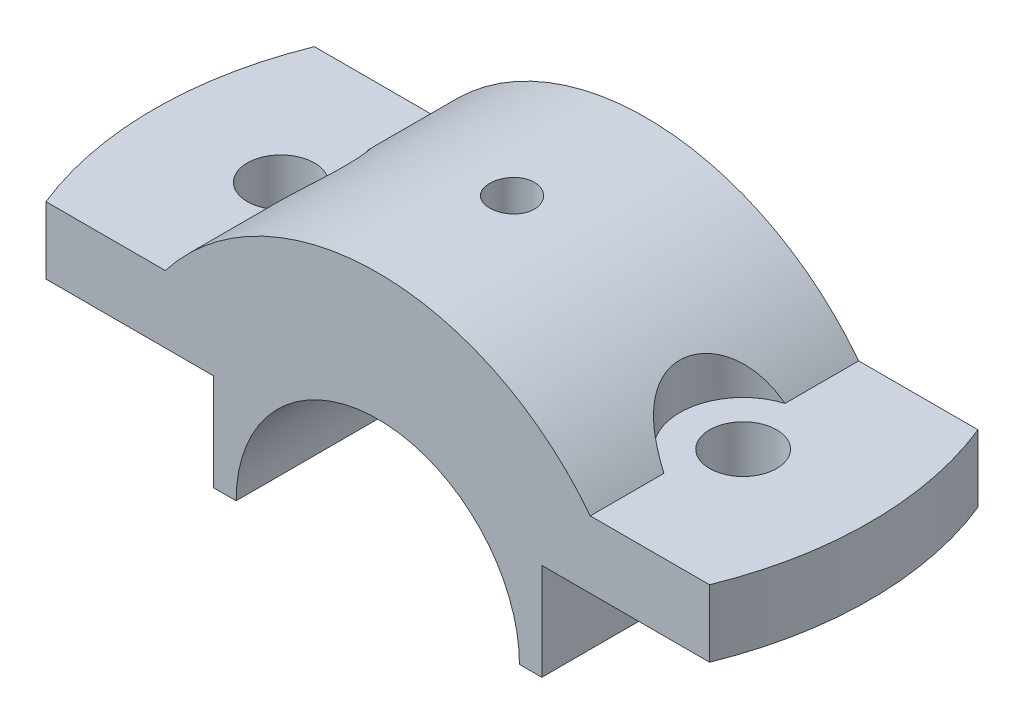
ISO-10303-21;
HEADER;
FILE_DESCRIPTION(('STEP AP214'),'2;1');
FILE_NAME('part.step','',(''),(''),'','','');
FILE_SCHEMA(('AUTOMOTIVE_DESIGN { 1 0 10303 214 1 1 1 1 }'));
ENDSEC;
DATA;
#1=APPLICATION_CONTEXT('core data for automotive mechanical design processes');
#2=APPLICATION_PROTOCOL_DEFINITION('international standard','automotive_design',2000,#1);
#3=PRODUCT_CONTEXT('',#1,'mechanical');
#4=PRODUCT('Part','Part','',(#3));
#5=PRODUCT_RELATED_PRODUCT_CATEGORY('part','',(#4));
#6=PRODUCT_DEFINITION_FORMATION('','',#4);
#7=PRODUCT_DEFINITION_CONTEXT('part definition',#1,'design');
#8=PRODUCT_DEFINITION('design','',#6,#7);
#9=PRODUCT_DEFINITION_SHAPE('','',#8);
#10=(LENGTH_UNIT() NAMED_UNIT(*) SI_UNIT(.MILLI.,.METRE.));
#11=(NAMED_UNIT(*) PLANE_ANGLE_UNIT() SI_UNIT($,.RADIAN.));
#12=(NAMED_UNIT(*) SI_UNIT($,.STERADIAN.) SOLID_ANGLE_UNIT());
#13=UNCERTAINTY_MEASURE_WITH_UNIT(LENGTH_MEASURE(1.E-05),#10,'distance_accuracy_value','');
#14=(GEOMETRIC_REPRESENTATION_CONTEXT(3) GLOBAL_UNCERTAINTY_ASSIGNED_CONTEXT((#13)) GLOBAL_UNIT_ASSIGNED_CONTEXT((#10,
#11,#12)) REPRESENTATION_CONTEXT('',''));
#15=CARTESIAN_POINT('',(0.,0.,0.));
#16=DIRECTION('',(0.,0.,1.));
#17=DIRECTION('',(1.,0.,0.));
#18=AXIS2_PLACEMENT_3D('',#15,#16,#17);
#19=CARTESIAN_POINT('',(0.,6.,18.));
#20=DIRECTION('',(0.,0.,-1.));
#21=DIRECTION('',(-1.,0.,0.));
#22=AXIS2_PLACEMENT_3D('',#19,#20,#21);
#23=CYLINDRICAL_SURFACE('',#22,36.);
#24=CARTESIAN_POINT('',(28.49561369755,28.,-8.12268731689832));
#25=CARTESIAN_POINT('',(28.3883429956897,28.1389449038792,-8.08961032460877));
#26=CARTESIAN_POINT('',(28.2803517799696,28.2767174981742,-8.05399064427992));
#27=CARTESIAN_POINT('',(28.0631084249399,28.5497756965527,-7.97733985421052));
#28=CARTESIAN_POINT('',(27.9538560857525,28.6850608973445,-7.93630787561411));
#29=CARTESIAN_POINT('',(27.624064794657,29.0874726458448,-7.80443543463378));
#30=CARTESIAN_POINT('',(27.4019476568077,29.350565318649,-7.7049558228802));
#31=CARTESIAN_POINT('',(26.9535217386165,29.8668357179367,-7.47928466451793));
#32=CARTESIAN_POINT('',(26.7271935399044,30.1198771773695,-7.35281860163648));
#33=CARTESIAN_POINT('',(26.2759869991675,30.6106353698816,-7.0713707967826));
#34=CARTESIAN_POINT('',(26.0511074262058,30.848367284912,-6.91641791105808));
#35=CARTESIAN_POINT('',(25.6748826842322,31.2358757966231,-6.62803093506917));
#36=CARTESIAN_POINT('',(25.5221415176003,31.3902627098833,-6.50257691639347));
#37=CARTESIAN_POINT('',(25.2208416805143,31.6895733918695,-6.23632306486193));
#38=CARTESIAN_POINT('',(25.0722819827196,31.8344994967615,-6.09552704351683));
#39=CARTESIAN_POINT('',(24.7817037096736,32.1133600457314,-5.79877146781272));
#40=CARTESIAN_POINT('',(24.6396622991177,32.247334392497,-5.64287194094596));
#41=CARTESIAN_POINT('',(24.3635406556831,32.5038371601368,-5.31537913185122));
#42=CARTESIAN_POINT('',(24.2294591470371,32.6263674170184,-5.14378837578346));
#43=CARTESIAN_POINT('',(23.9904509819345,32.8417624711389,-4.81162122960556));
#44=CARTESIAN_POINT('',(23.8841398500846,32.9363379004424,-4.65314864351983));
#45=CARTESIAN_POINT('',(23.6802965576756,33.115714689819,-4.32540935764653));
#46=CARTESIAN_POINT('',(23.5827627586561,33.2005178749047,-4.15614468253373));
#47=CARTESIAN_POINT('',(23.3978102955432,33.3597768046585,-3.80732279303356));
#48=CARTESIAN_POINT('',(23.3103987752574,33.4342252488207,-3.62775844168245));
#49=CARTESIAN_POINT('',(23.147151883429,33.5721015400056,-3.25935042000544));
#50=CARTESIAN_POINT('',(23.0713166506265,33.6355292549477,-3.07050663850279));
#51=CARTESIAN_POINT('',(22.9321367747935,33.7511322556298,-2.6836656627764));
#52=CARTESIAN_POINT('',(22.8688621846752,33.8032445767836,-2.48562433728759));
#53=CARTESIAN_POINT('',(22.7564750532109,33.895306588694,-2.08279108022074));
#54=CARTESIAN_POINT('',(22.7073627482296,33.9352560764568,-1.8779990360386));
#55=CARTESIAN_POINT('',(22.6242601718905,34.0026019753348,-1.46343860862133));
#56=CARTESIAN_POINT('',(22.5902628078343,34.0300042744095,-1.25367260819839));
#57=CARTESIAN_POINT('',(22.5380318988656,34.0720190124141,-0.830928192550831));
#58=CARTESIAN_POINT('',(22.51979677656,34.0866327311523,-0.617950100944409));
#59=CARTESIAN_POINT('',(22.5004913633291,34.1020997752325,-0.212628566388742));
#60=CARTESIAN_POINT('',(22.497854802396,34.1042087688774,-0.0204050310327507));
#61=CARTESIAN_POINT('',(22.5056099635788,34.097999008733,0.363610565532796));
#62=CARTESIAN_POINT('',(22.5160013311382,34.0896805387283,0.555402638342344));
#63=CARTESIAN_POINT('',(22.5496390603622,34.062684114114,0.937066674771809));
#64=CARTESIAN_POINT('',(22.5728821657172,34.0440087836706,1.1269391123751));
#65=CARTESIAN_POINT('',(22.6318470056782,33.9964450023637,1.50343686718247));
#66=CARTESIAN_POINT('',(22.6675688598692,33.9675564536259,1.6900621532508));
#67=CARTESIAN_POINT('',(22.7499755259529,33.9005620378108,2.05455855243696));
#68=CARTESIAN_POINT('',(22.7963912886814,33.8626817814698,2.23253225524283));
#69=CARTESIAN_POINT('',(22.899943159068,33.7776364962229,2.58311822676518));
#70=CARTESIAN_POINT('',(22.957082779793,33.7304684244387,2.75572871686819));
#71=CARTESIAN_POINT('',(23.0812634454929,33.627192986098,3.09453698451963));
#72=CARTESIAN_POINT('',(23.1483022314465,33.5710876588225,3.26073621425327));
#73=CARTESIAN_POINT('',(23.2914316150844,33.4502820102928,3.58602340185803));
#74=CARTESIAN_POINT('',(23.3675255332824,33.3855785350795,3.74510872145834));
#75=CARTESIAN_POINT('',(23.533252580508,33.2433246473684,4.0660140503512));
#76=CARTESIAN_POINT('',(23.623454305258,33.1652001012255,4.22728566326227));
#77=CARTESIAN_POINT('',(23.8119380159658,33.0001352649935,4.5403938002285));
#78=CARTESIAN_POINT('',(23.9102232179064,32.9131914629533,4.69222652646232));
#79=CARTESIAN_POINT('',(24.1136413044609,32.7310853663116,4.98597770349862));
#80=CARTESIAN_POINT('',(24.2187726643371,32.6359249001509,5.1278983473706));
#81=CARTESIAN_POINT('',(24.4347669427714,32.4379206709831,5.40167880401735));
#82=CARTESIAN_POINT('',(24.5456310123462,32.3350753631499,5.53353658310335));
#83=CARTESIAN_POINT('',(24.822492443997,32.0747818585769,5.84369630347675));
#84=CARTESIAN_POINT('',(24.9910291117,31.9134362337436,6.01648777656109));
#85=CARTESIAN_POINT('',(25.3348030409857,31.5774427466892,6.34125494264379));
#86=CARTESIAN_POINT('',(25.5100429600618,31.402789580918,6.49322226820977));
#87=CARTESIAN_POINT('',(25.8651555357775,31.0411295792422,6.77755742192985));
#88=CARTESIAN_POINT('',(26.0450417791957,30.8540832094598,6.9098576850827));
#89=CARTESIAN_POINT('',(26.4066048290322,30.4695902961508,7.15531019534775));
#90=CARTESIAN_POINT('',(26.5882813073606,30.2721456304919,7.26846588440781));
#91=CARTESIAN_POINT('',(26.9163314018469,29.9073020355787,7.45668423696381));
#92=CARTESIAN_POINT('',(27.0627139489859,29.7415082358916,7.5348778482434));
#93=CARTESIAN_POINT('',(27.3546693051919,29.4045244685477,7.6803751331004));
#94=CARTESIAN_POINT('',(27.5002421144228,29.2333345019822,7.74767880888012));
#95=CARTESIAN_POINT('',(27.7886657121799,28.8875574614039,7.87157992535376));
#96=CARTESIAN_POINT('',(27.931529113767,28.713011468592,7.92826325949936));
#97=CARTESIAN_POINT('',(28.2152179439878,28.3596276236826,8.03229531552802));
#98=CARTESIAN_POINT('',(28.3560440173533,28.1807911791704,8.07964705313067));
#99=CARTESIAN_POINT('',(28.49561369755,28.,8.12268731689833));
#100=B_SPLINE_CURVE_WITH_KNOTS('',3,(#24,#25,#26,#27,#28,#29,#30,#31,#32,#33,#34,#35,#36,#37,
#38,#39,#40,#41,#42,#43,#44,#45,#46,#47,#48,#49,#50,#51,#52,#53,#54,#55,#56,#57,#58,#59,#60,#61,
#62,#63,#64,#65,#66,#67,#68,#69,#70,#71,#72,#73,#74,#75,#76,#77,#78,#79,#80,#81,#82,#83,#84,#85,
#86,#87,#88,#89,#90,#91,#92,#93,#94,#95,#96,#97,#98,#99),.UNSPECIFIED.,.F.,.F.,(4,2,2,2,2,2,2,2,
2,2,2,2,2,2,2,2,2,2,2,2,2,2,2,2,2,2,2,2,2,2,2,2,2,2,2,2,2,4),(0.,0.535828027991022,
1.07174217932421,2.1458403738668,3.23143526368291,4.31593647962146,5.06775834846669,
5.81939386147159,6.56815589387726,7.31679759319879,7.9551044460551,8.59329189824958,
9.23192704166824,9.87056983843394,10.5126801305605,11.1548011387114,11.7966205121982,
12.4383756487133,13.0144245972337,13.5904578688623,14.1663452548777,14.7422381598258,
15.3049767404347,15.8678999933871,16.4306949834014,16.9936969898067,17.5949457219388,
18.1964348267228,18.7977904263809,19.3992672389542,20.2689684172323,21.1390180352076,
22.0119908106056,22.8848064695746,23.5882401398081,24.2916736677842,24.9891461674246,
25.6863928918425),.UNSPECIFIED.);
#101=CARTESIAN_POINT('',(28.49561369755,28.,-8.12268731689833));
#102=VERTEX_POINT('',#101);
#103=CARTESIAN_POINT('',(28.49561369755,28.,8.12268731689832));
#104=VERTEX_POINT('',#103);
#105=EDGE_CURVE('E141',#102,#104,#100,.T.);
#106=ORIENTED_EDGE('',*,*,#105,.F.);
#107=DIRECTION('',(0.,0.,-1.));
#108=VECTOR('',#107,1.);
#109=CARTESIAN_POINT('',(28.49561369755,28.,18.));
#110=LINE('',#109,#108);
#111=CARTESIAN_POINT('',(28.49561369755,28.,-18.));
#112=VERTEX_POINT('',#111);
#113=EDGE_CURVE('E148',#102,#112,#110,.T.);
#114=ORIENTED_EDGE('',*,*,#113,.T.);
#115=CARTESIAN_POINT('',(0.,6.,-18.));
#116=DIRECTION('',(0.,0.,1.));
#117=DIRECTION('',(1.,0.,0.));
#118=AXIS2_PLACEMENT_3D('',#115,#116,#117);
#119=CIRCLE('',#118,36.);
#120=CARTESIAN_POINT('',(-28.49561369755,28.,-18.));
#121=VERTEX_POINT('',#120);
#122=EDGE_CURVE('E435',#112,#121,#119,.T.);
#123=ORIENTED_EDGE('',*,*,#122,.T.);
#124=DIRECTION('',(0.,0.,-1.));
#125=VECTOR('',#124,1.);
#126=CARTESIAN_POINT('',(-28.49561369755,28.,18.));
#127=LINE('',#126,#125);
#128=CARTESIAN_POINT('',(-28.49561369755,28.,-8.12268731689832));
#129=VERTEX_POINT('',#128);
#130=EDGE_CURVE('E160',#129,#121,#127,.T.);
#131=ORIENTED_EDGE('',*,*,#130,.F.);
#132=CARTESIAN_POINT('',(-28.49561369755,28.,8.12268731689832));
#133=CARTESIAN_POINT('',(-28.3883429956897,28.1389449038792,8.08961032460876));
#134=CARTESIAN_POINT('',(-28.2803517799696,28.2767174981742,8.05399064427992));
#135=CARTESIAN_POINT('',(-28.0631084249399,28.5497756965527,7.97733985421052));
#136=CARTESIAN_POINT('',(-27.9538560857525,28.6850608973446,7.93630787561411));
#137=CARTESIAN_POINT('',(-27.624064794657,29.0874726458448,7.80443543463377));
#138=CARTESIAN_POINT('',(-27.4019476568077,29.350565318649,7.7049558228802));
#139=CARTESIAN_POINT('',(-26.9535217386165,29.8668357179367,7.47928466451793));
#140=CARTESIAN_POINT('',(-26.7271935399044,30.1198771773695,7.35281860163648));
#141=CARTESIAN_POINT('',(-26.2759869991675,30.6106353698816,7.0713707967826));
#142=CARTESIAN_POINT('',(-26.0511074262058,30.848367284912,6.91641791105808));
#143=CARTESIAN_POINT('',(-25.6748826842322,31.2358757966231,6.62803093506917));
#144=CARTESIAN_POINT('',(-25.5221415176003,31.3902627098833,6.50257691639347));
#145=CARTESIAN_POINT('',(-25.2208416805143,31.6895733918695,6.23632306486193));
#146=CARTESIAN_POINT('',(-25.0722819827196,31.8344994967615,6.09552704351684));
#147=CARTESIAN_POINT('',(-24.7817037096736,32.1133600457314,5.79877146781272));
#148=CARTESIAN_POINT('',(-24.6396622991177,32.247334392497,5.64287194094597));
#149=CARTESIAN_POINT('',(-24.3635406556831,32.5038371601367,5.31537913185122));
#150=CARTESIAN_POINT('',(-24.2294591470371,32.6263674170184,5.14378837578346));
#151=CARTESIAN_POINT('',(-23.9904509819345,32.8417624711389,4.81162122960557));
#152=CARTESIAN_POINT('',(-23.8841398500846,32.9363379004424,4.65314864351984));
#153=CARTESIAN_POINT('',(-23.6802965576756,33.115714689819,4.32540935764653));
#154=CARTESIAN_POINT('',(-23.5827627586561,33.2005178749047,4.15614468253374));
#155=CARTESIAN_POINT('',(-23.3978102955432,33.3597768046585,3.80732279303356));
#156=CARTESIAN_POINT('',(-23.3103987752574,33.4342252488207,3.62775844168246));
#157=CARTESIAN_POINT('',(-23.147151883429,33.5721015400056,3.25935042000545));
#158=CARTESIAN_POINT('',(-23.0713166506265,33.6355292549477,3.0705066385028));
#159=CARTESIAN_POINT('',(-22.9321367747935,33.7511322556298,2.68366566277641));
#160=CARTESIAN_POINT('',(-22.8688621846752,33.8032445767836,2.4856243372876));
#161=CARTESIAN_POINT('',(-22.756475053211,33.8953065886939,2.08279108022075));
#162=CARTESIAN_POINT('',(-22.7073627482296,33.9352560764568,1.87799903603861));
#163=CARTESIAN_POINT('',(-22.6242601718905,34.0026019753348,1.46343860862134));
#164=CARTESIAN_POINT('',(-22.5902628078343,34.0300042744095,1.2536726081984));
#165=CARTESIAN_POINT('',(-22.5380318988656,34.0720190124141,0.830928192550843));
#166=CARTESIAN_POINT('',(-22.51979677656,34.0866327311523,0.617950100944421));
#167=CARTESIAN_POINT('',(-22.5004913633291,34.1020997752325,0.212628566388754));
#168=CARTESIAN_POINT('',(-22.497854802396,34.1042087688773,0.0204050310327627));
#169=CARTESIAN_POINT('',(-22.5056099635788,34.097999008733,-0.363610565532784));
#170=CARTESIAN_POINT('',(-22.5160013311382,34.0896805387283,-0.555402638342332));
#171=CARTESIAN_POINT('',(-22.5496390603622,34.062684114114,-0.937066674771794));
#172=CARTESIAN_POINT('',(-22.5728821657172,34.0440087836706,-1.12693911237509));
#173=CARTESIAN_POINT('',(-22.6318470056782,33.9964450023637,-1.50343686718245));
#174=CARTESIAN_POINT('',(-22.6675688598692,33.9675564536259,-1.69006215325079));
#175=CARTESIAN_POINT('',(-22.7499755259529,33.9005620378109,-2.05455855243695));
#176=CARTESIAN_POINT('',(-22.7963912886814,33.8626817814698,-2.23253225524282));
#177=CARTESIAN_POINT('',(-22.899943159068,33.7776364962229,-2.58311822676516));
#178=CARTESIAN_POINT('',(-22.957082779793,33.7304684244387,-2.75572871686818));
#179=CARTESIAN_POINT('',(-23.0812634454929,33.627192986098,-3.09453698451961));
#180=CARTESIAN_POINT('',(-23.1483022314465,33.5710876588225,-3.26073621425325));
#181=CARTESIAN_POINT('',(-23.2914316150844,33.4502820102928,-3.58602340185802));
#182=CARTESIAN_POINT('',(-23.3675255332824,33.3855785350795,-3.74510872145833));
#183=CARTESIAN_POINT('',(-23.533252580508,33.2433246473685,-4.06601405035119));
#184=CARTESIAN_POINT('',(-23.623454305258,33.1652001012255,-4.22728566326226));
#185=CARTESIAN_POINT('',(-23.8119380159658,33.0001352649935,-4.54039380022849));
#186=CARTESIAN_POINT('',(-23.9102232179064,32.9131914629533,-4.69222652646231));
#187=CARTESIAN_POINT('',(-24.1136413044609,32.7310853663116,-4.98597770349861));
#188=CARTESIAN_POINT('',(-24.2187726643371,32.6359249001509,-5.12789834737059));
#189=CARTESIAN_POINT('',(-24.4347669427714,32.4379206709831,-5.40167880401734));
#190=CARTESIAN_POINT('',(-24.5456310123461,32.3350753631499,-5.53353658310334));
#191=CARTESIAN_POINT('',(-24.822492443997,32.0747818585769,-5.84369630347674));
#192=CARTESIAN_POINT('',(-24.9910291117,31.9134362337436,-6.01648777656109));
#193=CARTESIAN_POINT('',(-25.3348030409857,31.5774427466892,-6.34125494264379));
#194=CARTESIAN_POINT('',(-25.5100429600618,31.402789580918,-6.49322226820977));
#195=CARTESIAN_POINT('',(-25.8651555357775,31.0411295792422,-6.77755742192985));
#196=CARTESIAN_POINT('',(-26.0450417791957,30.8540832094598,-6.90985768508269));
#197=CARTESIAN_POINT('',(-26.4066048290322,30.4695902961508,-7.15531019534775));
#198=CARTESIAN_POINT('',(-26.5882813073606,30.2721456304919,-7.26846588440781));
#199=CARTESIAN_POINT('',(-26.9163314018469,29.9073020355787,-7.45668423696381));
#200=CARTESIAN_POINT('',(-27.0627139489859,29.7415082358916,-7.5348778482434));
#201=CARTESIAN_POINT('',(-27.3546693051919,29.4045244685478,-7.6803751331004));
#202=CARTESIAN_POINT('',(-27.5002421144228,29.2333345019822,-7.74767880888012));
#203=CARTESIAN_POINT('',(-27.7886657121799,28.8875574614039,-7.87157992535375));
#204=CARTESIAN_POINT('',(-27.931529113767,28.713011468592,-7.92826325949936));
#205=CARTESIAN_POINT('',(-28.2152179439878,28.3596276236826,-8.03229531552801));
#206=CARTESIAN_POINT('',(-28.3560440173533,28.1807911791704,-8.07964705313067));
#207=CARTESIAN_POINT('',(-28.49561369755,28.,-8.12268731689832));
#208=B_SPLINE_CURVE_WITH_KNOTS('',3,(#132,#133,#134,#135,#136,#137,#138,#139,#140,#141,#142,
#143,#144,#145,#146,#147,#148,#149,#150,#151,#152,#153,#154,#155,#156,#157,#158,#159,#160,#161,
#162,#163,#164,#165,#166,#167,#168,#169,#170,#171,#172,#173,#174,#175,#176,#177,#178,#179,#180,
#181,#182,#183,#184,#185,#186,#187,#188,#189,#190,#191,#192,#193,#194,#195,#196,#197,#198,#199,
#200,#201,#202,#203,#204,#205,#206,#207),.UNSPECIFIED.,.F.,.F.,(4,2,2,2,2,2,2,2,2,2,2,2,2,2,2,2,
2,2,2,2,2,2,2,2,2,2,2,2,2,2,2,2,2,2,2,2,2,4),(0.,0.53582802799102,1.07174217932421,
2.1458403738668,3.23143526368291,4.31593647962146,5.06775834846668,5.81939386147158,
6.56815589387725,7.31679759319878,7.95510444605509,8.59329189824957,9.23192704166822,
9.87056983843392,10.5126801305605,11.1548011387114,11.7966205121981,12.4383756487133,
13.0144245972337,13.5904578688623,14.1663452548777,14.7422381598258,15.3049767404347,
15.8678999933871,16.4306949834014,16.9936969898067,17.5949457219388,18.1964348267228,
18.7977904263809,19.3992672389542,20.2689684172323,21.1390180352076,22.0119908106056,
22.8848064695746,23.5882401398081,24.2916736677842,24.9891461674246,25.6863928918424),.UNSPECIFIED.);
#209=CARTESIAN_POINT('',(-28.49561369755,28.,8.12268731689832));
#210=VERTEX_POINT('',#209);
#211=EDGE_CURVE('E12',#210,#129,#208,.T.);
#212=ORIENTED_EDGE('',*,*,#211,.F.);
#213=CARTESIAN_POINT('',(-28.49561369755,28.,18.));
#214=VERTEX_POINT('',#213);
#215=EDGE_CURVE('E157',#214,#210,#127,.T.);
#216=ORIENTED_EDGE('',*,*,#215,.F.);
#217=CARTESIAN_POINT('',(0.,6.,18.));
#218=DIRECTION('',(0.,0.,1.));
#219=DIRECTION('',(1.,0.,0.));
#220=AXIS2_PLACEMENT_3D('',#217,#218,#219);
#221=CIRCLE('',#220,36.);
#222=CARTESIAN_POINT('',(28.49561369755,28.,18.));
#223=VERTEX_POINT('',#222);
#224=EDGE_CURVE('E471',#223,#214,#221,.T.);
#225=ORIENTED_EDGE('',*,*,#224,.F.);
#226=EDGE_CURVE('E151',#223,#104,#110,.T.);
#227=ORIENTED_EDGE('',*,*,#226,.T.);
#228=EDGE_LOOP('',(#106,#114,#123,#131,#212,#216,#225,#227));
#229=FACE_BOUND('',#228,.T.);
#230=CARTESIAN_POINT('',(0.,42.,-3.));
#231=CARTESIAN_POINT('',(-0.168198269763613,41.9999983623455,-2.99999265352116));
#232=CARTESIAN_POINT('',(-0.336511041540677,41.9988086563019,-2.98580709056686));
#233=CARTESIAN_POINT('',(-0.668479712101168,41.9941770698475,-2.92942694443476));
#234=CARTESIAN_POINT('',(-0.83213011567569,41.9907326379508,-2.88720062908529));
#235=CARTESIAN_POINT('',(-1.14991806754278,41.9819808373831,-2.77596853857189));
#236=CARTESIAN_POINT('',(-1.30406094127385,41.9766745229546,-2.70697791567055));
#237=CARTESIAN_POINT('',(-1.59854170024823,41.9647940323414,-2.54420270438402));
#238=CARTESIAN_POINT('',(-1.73888252965616,41.9582201274407,-2.45042341956747));
#239=CARTESIAN_POINT('',(-2.00216999989677,41.9445233960014,-2.24047480018201));
#240=CARTESIAN_POINT('',(-2.12507661724848,41.9373993625973,-2.12425534819294));
#241=CARTESIAN_POINT('',(-2.34966340060966,41.923415424095,-1.8728313124502));
#242=CARTESIAN_POINT('',(-2.45134263411452,41.9165555306112,-1.73762589509213));
#243=CARTESIAN_POINT('',(-2.63072376717069,41.9038635798373,-1.45182564870291));
#244=CARTESIAN_POINT('',(-2.70839049885463,41.8980330354028,-1.30120867379168));
#245=CARTESIAN_POINT('',(-2.83731730132153,41.8880737334482,-0.989015113332052));
#246=CARTESIAN_POINT('',(-2.88857783853725,41.8839449458689,-0.827438721425248));
#247=CARTESIAN_POINT('',(-2.96312108945571,41.8778667619896,-0.498313824356468));
#248=CARTESIAN_POINT('',(-2.98646899616932,41.8759122880866,-0.330780180022195));
#249=CARTESIAN_POINT('',(-3.00472562404628,41.8743879696443,0.00583861183609568));
#250=CARTESIAN_POINT('',(-2.99963487893861,41.8748180803518,0.174923730183007));
#251=CARTESIAN_POINT('',(-2.96121259264454,41.8780097208491,0.509398996531562));
#252=CARTESIAN_POINT('',(-2.92795190411417,41.8807654013356,0.674797347229236));
#253=CARTESIAN_POINT('',(-2.83424395614882,41.888288507081,0.997655602178857));
#254=CARTESIAN_POINT('',(-2.77379643119035,41.893055951988,1.15511542888156));
#255=CARTESIAN_POINT('',(-2.6273513644561,41.9040721412056,1.45785271763429));
#256=CARTESIAN_POINT('',(-2.54132203427158,41.9103227265289,1.60311473276252));
#257=CARTESIAN_POINT('',(-2.34617833174004,41.9235992059164,1.87716401645941));
#258=CARTESIAN_POINT('',(-2.23706349186762,41.9306251156809,2.00595095129164));
#259=CARTESIAN_POINT('',(-1.99844874667909,41.9446866123493,2.2438062578447));
#260=CARTESIAN_POINT('',(-1.86888758817173,41.951722163252,2.35281319238775));
#261=CARTESIAN_POINT('',(-1.59327166911525,41.964989756095,2.54753917016566));
#262=CARTESIAN_POINT('',(-1.44721689754601,41.9712217974986,2.63325819784067));
#263=CARTESIAN_POINT('',(-1.14271977980355,41.9821813742892,2.77897128800611));
#264=CARTESIAN_POINT('',(-0.984276125427223,41.9869087505233,2.83896262943446));
#265=CARTESIAN_POINT('',(-0.659517207058746,41.9943245223539,2.93147439735398));
#266=CARTESIAN_POINT('',(-0.493202106506566,41.9970129602666,2.96399539396578));
#267=CARTESIAN_POINT('',(-0.157953900492754,42.0000425082915,3.00056629212473));
#268=CARTESIAN_POINT('',(0.0109698873455861,42.0003906147601,3.00470105432069));
#269=CARTESIAN_POINT('',(0.347108257509907,41.998718963361,2.98460441811805));
#270=CARTESIAN_POINT('',(0.514322855764237,41.9966992275802,2.96037328431162));
#271=CARTESIAN_POINT('',(0.842054268674095,41.9905235352396,2.88430302416972));
#272=CARTESIAN_POINT('',(1.00258027541916,41.9863706225226,2.83250323192257));
#273=CARTESIAN_POINT('',(1.31266249524746,41.9763951033705,2.70280623665391));
#274=CARTESIAN_POINT('',(1.46221853484939,41.9705724705373,2.6249086210245));
#275=CARTESIAN_POINT('',(1.74650165490572,41.957892791809,2.44501395235093));
#276=CARTESIAN_POINT('',(1.88119305156441,41.9510333465621,2.34296068081552));
#277=CARTESIAN_POINT('',(2.13156328453086,41.9370587591909,2.11773282884855));
#278=CARTESIAN_POINT('',(2.24724179044315,41.9299436126258,1.9945578814522));
#279=CARTESIAN_POINT('',(2.4565936363653,41.9162388364746,1.73021492340498));
#280=CARTESIAN_POINT('',(2.55021159970091,41.9096505562267,1.5890029764078));
#281=CARTESIAN_POINT('',(2.71240518851855,41.8977645523296,1.29281321140975));
#282=CARTESIAN_POINT('',(2.78098106402989,41.8924668157955,1.13783553087019));
#283=CARTESIAN_POINT('',(2.89104953232169,41.8837692854682,0.818709628382286));
#284=CARTESIAN_POINT('',(2.93257602434787,41.880367116859,0.654573165857009));
#285=CARTESIAN_POINT('',(2.98747730973046,41.8758379707255,0.321627900376728));
#286=CARTESIAN_POINT('',(3.0008526437048,41.8747109495091,0.152819187211216));
#287=CARTESIAN_POINT('',(2.99906568867279,41.8748603385058,-0.184128378062685));
#288=CARTESIAN_POINT('',(2.98399040933217,41.8761294207921,-0.352267701709311));
#289=CARTESIAN_POINT('',(2.92591158988509,41.8809124524692,-0.683617600652551));
#290=CARTESIAN_POINT('',(2.88290800718288,41.8844264052839,-0.846828168431517));
#291=CARTESIAN_POINT('',(2.77021533005119,41.8933013139511,-1.16369328979985));
#292=CARTESIAN_POINT('',(2.7005278020196,41.8986621613857,-1.31734840369706));
#293=CARTESIAN_POINT('',(2.53645517684175,41.9106269962521,-1.610792521721));
#294=CARTESIAN_POINT('',(2.44207046734367,41.9172309641714,-1.75058174343997));
#295=CARTESIAN_POINT('',(2.23095582636734,41.9309619509604,-2.01277121703903));
#296=CARTESIAN_POINT('',(2.11416148122438,41.9380904401723,-2.13511952597204));
#297=CARTESIAN_POINT('',(1.8616596767774,41.9520538502904,-2.35852555560995));
#298=CARTESIAN_POINT('',(1.72594764792327,41.9588886997447,-2.45957811748804));
#299=CARTESIAN_POINT('',(1.43920131908824,41.9715070452682,-2.63765958125268));
#300=CARTESIAN_POINT('',(1.28813896881162,41.9772885606931,-2.71464341596898));
#301=CARTESIAN_POINT('',(0.975287255987201,41.987125575489,-2.84205540915383));
#302=CARTESIAN_POINT('',(0.813510466240954,41.9911830578477,-2.89251409286431));
#303=CARTESIAN_POINT('',(0.542316144290039,41.9960732320155,-2.95259274750614));
#304=CARTESIAN_POINT('',(0.434642683315412,41.9975390663086,-2.97034683755246));
#305=CARTESIAN_POINT('',(0.217995514503488,41.999502979759,-2.99405282903161));
#306=CARTESIAN_POINT('',(0.109021810119135,42.0000010614857,-3.0000047617994));
#307=CARTESIAN_POINT('',(0.,42.,-3.));
#308=B_SPLINE_CURVE_WITH_KNOTS('',3,(#230,#231,#232,#233,#234,#235,#236,#237,#238,#239,#240,
#241,#242,#243,#244,#245,#246,#247,#248,#249,#250,#251,#252,#253,#254,#255,#256,#257,#258,#259,
#260,#261,#262,#263,#264,#265,#266,#267,#268,#269,#270,#271,#272,#273,#274,#275,#276,#277,#278,
#279,#280,#281,#282,#283,#284,#285,#286,#287,#288,#289,#290,#291,#292,#293,#294,#295,#296,#297,
#298,#299,#300,#301,#302,#303,#304,#305,#306,#307),.UNSPECIFIED.,.T.,.F.,(4,2,2,2,2,2,2,2,2,2,2,
2,2,2,2,2,2,2,2,2,2,2,2,2,2,2,2,2,2,2,2,2,2,2,2,2,2,2,4),(0.,0.504196760400417,1.0089650669935,
1.51344802166686,2.01782312875254,2.52333800635729,3.02887508621794,3.53514908853274,
4.04141414783702,4.54649444494759,5.05156526287856,5.55536949330868,6.05917864430996,
6.56361647246697,7.0680645174258,7.57405352805448,8.08004287675933,8.5860857277135,
9.09211807597604,9.59663697921505,10.1011511764266,10.6049474709236,11.1087517308412,
11.6137402492478,12.1187375421375,12.624989294736,13.1312359925948,13.6368470172278,
14.1424483319627,14.6465058864758,15.1505642097702,15.6545929484257,16.1586137762957,
16.6641056599392,17.1697198569744,17.6762751918766,18.1822462977536,18.5090545906998,
18.8358620159624),.UNSPECIFIED.);
#309=CARTESIAN_POINT('',(0.,42.,-3.));
#310=VERTEX_POINT('',#309);
#311=EDGE_CURVE('E38',#310,#310,#308,.T.);
#312=ORIENTED_EDGE('',*,*,#311,.F.);
#313=EDGE_LOOP('',(#312));
#314=FACE_BOUND('',#313,.T.);
#315=ADVANCED_FACE('F34',(#229,#314),#23,.T.);
#316=CARTESIAN_POINT('',(0.,6.,18.));
#317=DIRECTION('',(0.,0.,-1.));
#318=DIRECTION('',(-1.,0.,0.));
#319=AXIS2_PLACEMENT_3D('',#316,#317,#318);
#320=CYLINDRICAL_SURFACE('',#319,19.);
#321=CARTESIAN_POINT('',(0.,6.,-18.));
#322=DIRECTION('',(0.,0.,-1.));
#323=DIRECTION('',(1.,0.,0.));
#324=AXIS2_PLACEMENT_3D('',#321,#322,#323);
#325=CIRCLE('',#324,19.);
#326=CARTESIAN_POINT('',(-19.,6.,-18.));
#327=VERTEX_POINT('',#326);
#328=CARTESIAN_POINT('',(19.,6.,-18.));
#329=VERTEX_POINT('',#328);
#330=EDGE_CURVE('E403',#327,#329,#325,.T.);
#331=ORIENTED_EDGE('',*,*,#330,.T.);
#332=DIRECTION('',(0.,0.,-1.));
#333=VECTOR('',#332,1.);
#334=CARTESIAN_POINT('',(19.,6.,18.));
#335=LINE('',#334,#333);
#336=CARTESIAN_POINT('',(19.,6.,18.));
#337=VERTEX_POINT('',#336);
#338=EDGE_CURVE('E410',#337,#329,#335,.T.);
#339=ORIENTED_EDGE('',*,*,#338,.F.);
#340=CARTESIAN_POINT('',(0.,6.,18.));
#341=DIRECTION('',(0.,0.,-1.));
#342=DIRECTION('',(1.,0.,0.));
#343=AXIS2_PLACEMENT_3D('',#340,#341,#342);
#344=CIRCLE('',#343,19.);
#345=CARTESIAN_POINT('',(-19.,6.,18.));
#346=VERTEX_POINT('',#345);
#347=EDGE_CURVE('E409',#346,#337,#344,.T.);
#348=ORIENTED_EDGE('',*,*,#347,.F.);
#349=DIRECTION('',(0.,0.,-1.));
#350=VECTOR('',#349,1.);
#351=CARTESIAN_POINT('',(-19.,6.,18.));
#352=LINE('',#351,#350);
#353=EDGE_CURVE('E397',#346,#327,#352,.T.);
#354=ORIENTED_EDGE('',*,*,#353,.T.);
#355=EDGE_LOOP('',(#331,#339,#348,#354));
#356=FACE_BOUND('',#355,.T.);
#357=CARTESIAN_POINT('',(0.,25.,-2.5));
#358=CARTESIAN_POINT('',(0.139778315489381,24.999997967774,-2.49999410094607));
#359=CARTESIAN_POINT('',(0.279642447495433,24.9984412683557,-2.48823767475851));
#360=CARTESIAN_POINT('',(0.555474474016765,24.9923810422329,-2.44152700403635));
#361=CARTESIAN_POINT('',(0.691438217949604,24.9878744896332,-2.40654893872552));
#362=CARTESIAN_POINT('',(0.955436642925264,24.9764219373405,-2.31444705906102));
#363=CARTESIAN_POINT('',(1.08347675216936,24.9694776299244,-2.25733860465934));
#364=CARTESIAN_POINT('',(1.32813277832855,24.9539206812215,-2.12263165454415));
#365=CARTESIAN_POINT('',(1.44475055826477,24.9453083126858,-2.04503650793576));
#366=CARTESIAN_POINT('',(1.66398308687909,24.9273173646443,-1.87105538112387));
#367=CARTESIAN_POINT('',(1.76651843289982,24.9179348817316,-1.77456973952705));
#368=CARTESIAN_POINT('',(1.95399133146887,24.8994924119599,-1.56576064733009));
#369=CARTESIAN_POINT('',(2.03892796010931,24.890432442053,-1.4534363657436));
#370=CARTESIAN_POINT('',(2.18909162338547,24.8736225658863,-1.21561789849417));
#371=CARTESIAN_POINT('',(2.25424363629101,24.8658776941045,-1.09007595594653));
#372=CARTESIAN_POINT('',(2.36250946256607,24.8526269269547,-0.829713309668852));
#373=CARTESIAN_POINT('',(2.40562420041089,24.8471209376663,-0.694892995440668));
#374=CARTESIAN_POINT('',(2.46834893112872,24.8390089488849,-0.420627771177586));
#375=CARTESIAN_POINT('',(2.48809350572305,24.8363863510935,-0.281214139706504));
#376=CARTESIAN_POINT('',(2.50393399543624,24.8342874081065,-0.00102942145374153));
#377=CARTESIAN_POINT('',(2.50003096100307,24.8348109231579,0.139741604753912));
#378=CARTESIAN_POINT('',(2.46879737750758,24.8389298660036,0.417704097944482));
#379=CARTESIAN_POINT('',(2.44161547626708,24.8425058020086,0.554912597936803));
#380=CARTESIAN_POINT('',(2.3648278688215,24.852296258763,0.822803762753465));
#381=CARTESIAN_POINT('',(2.31522166359117,24.8585108382319,0.953486282278281));
#382=CARTESIAN_POINT('',(2.19483509097755,24.8729003199956,1.20507533515602));
#383=CARTESIAN_POINT('',(2.12399053069557,24.8810811502029,1.32595079901061));
#384=CARTESIAN_POINT('',(1.96318413435717,24.8984768576706,1.55415393130079));
#385=CARTESIAN_POINT('',(1.87322133002782,24.9076917872934,1.66148091311362));
#386=CARTESIAN_POINT('',(1.67591027855668,24.9262039286229,1.8604029509214));
#387=CARTESIAN_POINT('',(1.56843398279011,24.9355012293485,1.95187103488117));
#388=CARTESIAN_POINT('',(1.33958658891132,24.9530645440151,2.11548884034055));
#389=CARTESIAN_POINT('',(1.21821545257772,24.9613305551191,2.18763850869799));
#390=CARTESIAN_POINT('',(0.964922757293816,24.9759058695861,2.31057308687672));
#391=CARTESIAN_POINT('',(0.83299707263104,24.9822144030351,2.36134959301126));
#392=CARTESIAN_POINT('',(0.562390331231888,24.9921571388021,2.43999334343768));
#393=CARTESIAN_POINT('',(0.423709625549349,24.9957914799383,2.4678617769038));
#394=CARTESIAN_POINT('',(0.144626841595053,24.9999582136113,2.49973268466772));
#395=CARTESIAN_POINT('',(0.0042450539790032,25.0005133278906,2.50390998199236));
#396=CARTESIAN_POINT('',(-0.275216665266614,24.9985205333266,2.4887420573463));
#397=CARTESIAN_POINT('',(-0.414296627611643,24.9959726978817,2.46939739177319));
#398=CARTESIAN_POINT('',(-0.686687509149988,24.9880744020358,2.40787994096775));
#399=CARTESIAN_POINT('',(-0.820017679004481,24.9827342327916,2.36579096106223));
#400=CARTESIAN_POINT('',(-1.07772769061604,24.9698488481686,2.26006706877667));
#401=CARTESIAN_POINT('',(-1.20210719868892,24.9623035506347,2.19643135362992));
#402=CARTESIAN_POINT('',(-1.43916303555311,24.9457917882835,2.04900056518348));
#403=CARTESIAN_POINT('',(-1.55176881159962,24.9368174879556,1.96509294211364));
#404=CARTESIAN_POINT('',(-1.76136182953435,24.9184749473973,1.77965876593364));
#405=CARTESIAN_POINT('',(-1.85834838132062,24.9091066897838,1.67813143474596));
#406=CARTESIAN_POINT('',(-2.03457405133125,24.8909615049602,1.45956767417581));
#407=CARTESIAN_POINT('',(-2.11369695379329,24.882188695812,1.34243714901302));
#408=CARTESIAN_POINT('',(-2.25114524350548,24.8662967388838,1.0964463235499));
#409=CARTESIAN_POINT('',(-2.30947108507654,24.8591775549807,0.967586279563252));
#410=CARTESIAN_POINT('',(-2.40348340588749,24.8474274353122,0.702162244798242));
#411=CARTESIAN_POINT('',(-2.43923433050313,24.8427894223098,0.565621407141436));
#412=CARTESIAN_POINT('',(-2.48728896692712,24.8365068588229,0.288409154438024));
#413=CARTESIAN_POINT('',(-2.49959389747029,24.834862152745,0.147737954475761));
#414=CARTESIAN_POINT('',(-2.50038325713136,24.8347572836292,-0.132585217903333));
#415=CARTESIAN_POINT('',(-2.48905029281035,24.8362727080523,-0.272236701943022));
#416=CARTESIAN_POINT('',(-2.44327339157394,24.8422647251657,-0.547631014500267));
#417=CARTESIAN_POINT('',(-2.40882946081797,24.8467413170668,-0.683373844059531));
#418=CARTESIAN_POINT('',(-2.31786734754336,24.8581434764999,-0.947066981095646));
#419=CARTESIAN_POINT('',(-2.26135895042261,24.8650679582854,-1.0750207139318));
#420=CARTESIAN_POINT('',(-2.12788991460024,24.8805873470396,-1.3196597242388));
#421=CARTESIAN_POINT('',(-2.05092891076783,24.8891822838294,-1.4363448004849));
#422=CARTESIAN_POINT('',(-1.87806508524071,24.9071536004537,-1.65606643442981));
#423=CARTESIAN_POINT('',(-1.78202633147283,24.916535291463,-1.75899562327552));
#424=CARTESIAN_POINT('',(-1.57401834863999,24.9349767535594,-1.94734544374449));
#425=CARTESIAN_POINT('',(-1.46204538383397,24.9440364485309,-2.03276195806478));
#426=CARTESIAN_POINT('',(-1.22480279057949,24.9608556769231,-2.18397223906811));
#427=CARTESIAN_POINT('',(-1.09947920166897,24.9686095798624,-2.24968193582438));
#428=CARTESIAN_POINT('',(-0.839540973043681,24.9818871351467,-2.35902730105119));
#429=CARTESIAN_POINT('',(-0.704936491101718,24.9874131818538,-2.40268668066817));
#430=CARTESIAN_POINT('',(-0.474714442967835,24.9942975150946,-2.45637452622467));
#431=CARTESIAN_POINT('',(-0.380541684686488,24.9964253917168,-2.47271020697246));
#432=CARTESIAN_POINT('',(-0.190925958585041,24.9992773223142,-2.49452491255806));
#433=CARTESIAN_POINT('',(-0.0954830015668619,25.0000013882199,-2.50000402966206));
#434=CARTESIAN_POINT('',(0.,25.,-2.5));
#435=B_SPLINE_CURVE_WITH_KNOTS('',3,(#357,#358,#359,#360,#361,#362,#363,#364,#365,#366,#367,
#368,#369,#370,#371,#372,#373,#374,#375,#376,#377,#378,#379,#380,#381,#382,#383,#384,#385,#386,
#387,#388,#389,#390,#391,#392,#393,#394,#395,#396,#397,#398,#399,#400,#401,#402,#403,#404,#405,
#406,#407,#408,#409,#410,#411,#412,#413,#414,#415,#416,#417,#418,#419,#420,#421,#422,#423,#424,
#425,#426,#427,#428,#429,#430,#431,#432,#433,#434),.UNSPECIFIED.,.T.,.F.,(4,2,2,2,2,2,2,2,2,2,2,
2,2,2,2,2,2,2,2,2,2,2,2,2,2,2,2,2,2,2,2,2,2,2,2,2,2,2,4),(0.,0.418986144750716,
0.838402751295033,1.25752877489171,1.67658632335899,2.09791737096997,2.51927053226661,
2.94220203521433,3.36511579450622,3.78558208482052,4.20602969778296,4.62381238038424,
5.04160436068185,5.46067207111286,5.87976101093416,6.30206422391834,6.72436859858557,
7.14683886382433,7.56928719694784,7.98861407741509,8.40793103915519,8.82571338706288,
9.24351130200044,9.6636844083175,10.0838760739927,10.5067272952287,10.9295692785286,
11.3511986374782,11.7728060793191,12.1911686022117,12.6095310136043,13.027708095279,
13.4458926429743,13.8671712161902,14.2885487204712,14.7116990687392,15.1343934209874,
15.4206065905888,15.7068173277526),.UNSPECIFIED.);
#436=CARTESIAN_POINT('',(0.,25.,-2.5));
#437=VERTEX_POINT('',#436);
#438=EDGE_CURVE('E211',#437,#437,#435,.T.);
#439=ORIENTED_EDGE('',*,*,#438,.F.);
#440=EDGE_LOOP('',(#439));
#441=FACE_BOUND('',#440,.T.);
#442=ADVANCED_FACE('F204',(#356,#441),#320,.F.);
#443=CARTESIAN_POINT('',(22.,19.,18.));
#444=DIRECTION('',(0.,1.,0.));
#445=DIRECTION('',(-1.,0.,0.));
#446=AXIS2_PLACEMENT_3D('',#443,#444,#445);
#447=PLANE('',#446);
#448=CARTESIAN_POINT('',(31.,19.,0.));
#449=DIRECTION('',(0.,1.,0.));
#450=DIRECTION('',(-1.,0.,0.));
#451=AXIS2_PLACEMENT_3D('',#448,#449,#450);
#452=CIRCLE('',#451,4.5);
#453=CARTESIAN_POINT('',(26.5,19.,0.));
#454=VERTEX_POINT('',#453);
#455=EDGE_CURVE('E499',#454,#454,#452,.T.);
#456=ORIENTED_EDGE('',*,*,#455,.T.);
#457=EDGE_LOOP('',(#456));
#458=FACE_BOUND('',#457,.T.);
#459=CARTESIAN_POINT('',(0.,19.,0.));
#460=DIRECTION('',(0.,1.,0.));
#461=DIRECTION('',(-1.,0.,0.));
#462=AXIS2_PLACEMENT_3D('',#459,#460,#461);
#463=CIRCLE('',#462,48.);
#464=CARTESIAN_POINT('',(44.497190922574,19.,18.));
#465=VERTEX_POINT('',#464);
#466=CARTESIAN_POINT('',(44.497190922574,19.,-18.));
#467=VERTEX_POINT('',#466);
#468=EDGE_CURVE('E453',#465,#467,#463,.T.);
#469=ORIENTED_EDGE('',*,*,#468,.F.);
#470=DIRECTION('',(1.,0.,0.));
#471=VECTOR('',#470,1.);
#472=CARTESIAN_POINT('',(22.,19.,18.));
#473=LINE('',#472,#471);
#474=CARTESIAN_POINT('',(22.,19.,18.));
#475=VERTEX_POINT('',#474);
#476=EDGE_CURVE('E466',#475,#465,#473,.T.);
#477=ORIENTED_EDGE('',*,*,#476,.F.);
#478=DIRECTION('',(0.,0.,-1.));
#479=VECTOR('',#478,1.);
#480=CARTESIAN_POINT('',(22.,19.,18.));
#481=LINE('',#480,#479);
#482=CARTESIAN_POINT('',(22.,19.,-18.));
#483=VERTEX_POINT('',#482);
#484=EDGE_CURVE('E159',#475,#483,#481,.T.);
#485=ORIENTED_EDGE('',*,*,#484,.T.);
#486=DIRECTION('',(1.,0.,0.));
#487=VECTOR('',#486,1.);
#488=CARTESIAN_POINT('',(22.,19.,-18.));
#489=LINE('',#488,#487);
#490=EDGE_CURVE('E485',#483,#467,#489,.T.);
#491=ORIENTED_EDGE('',*,*,#490,.T.);
#492=EDGE_LOOP('',(#469,#477,#485,#491));
#493=FACE_BOUND('',#492,.T.);
#494=ADVANCED_FACE('F208',(#458,#493),#447,.F.);
#495=CARTESIAN_POINT('',(48.,28.,18.));
#496=DIRECTION('',(0.,-1.,0.));
#497=DIRECTION('',(0.,0.,-1.));
#498=AXIS2_PLACEMENT_3D('',#495,#496,#497);
#499=PLANE('',#498);
#500=CARTESIAN_POINT('',(31.,28.,0.));
#501=DIRECTION('',(0.,1.,0.));
#502=DIRECTION('',(0.,0.,-1.));
#503=AXIS2_PLACEMENT_3D('',#500,#501,#502);
#504=CIRCLE('',#503,4.5);
#505=CARTESIAN_POINT('',(31.,28.,-4.5));
#506=VERTEX_POINT('',#505);
#507=EDGE_CURVE('E502',#506,#506,#504,.T.);
#508=ORIENTED_EDGE('',*,*,#507,.F.);
#509=EDGE_LOOP('',(#508));
#510=FACE_BOUND('',#509,.T.);
#511=ORIENTED_EDGE('',*,*,#113,.F.);
#512=CARTESIAN_POINT('',(31.,28.,0.));
#513=DIRECTION('',(0.,1.,0.));
#514=DIRECTION('',(0.,0.,-1.));
#515=AXIS2_PLACEMENT_3D('',#512,#513,#514);
#516=CIRCLE('',#515,8.5);
#517=EDGE_CURVE('E55',#102,#104,#516,.T.);
#518=ORIENTED_EDGE('',*,*,#517,.T.);
#519=ORIENTED_EDGE('',*,*,#226,.F.);
#520=DIRECTION('',(-1.,0.,0.));
#521=VECTOR('',#520,1.);
#522=CARTESIAN_POINT('',(48.,28.,18.));
#523=LINE('',#522,#521);
#524=CARTESIAN_POINT('',(44.497190922574,28.,18.));
#525=VERTEX_POINT('',#524);
#526=EDGE_CURVE('E469',#525,#223,#523,.T.);
#527=ORIENTED_EDGE('',*,*,#526,.F.);
#528=CARTESIAN_POINT('',(0.,28.,0.));
#529=DIRECTION('',(0.,1.,0.));
#530=DIRECTION('',(0.,0.,1.));
#531=AXIS2_PLACEMENT_3D('',#528,#529,#530);
#532=CIRCLE('',#531,48.);
#533=CARTESIAN_POINT('',(44.497190922574,28.,-18.));
#534=VERTEX_POINT('',#533);
#535=EDGE_CURVE('E451',#525,#534,#532,.T.);
#536=ORIENTED_EDGE('',*,*,#535,.T.);
#537=DIRECTION('',(-1.,0.,0.));
#538=VECTOR('',#537,1.);
#539=CARTESIAN_POINT('',(48.,28.,-18.));
#540=LINE('',#539,#538);
#541=EDGE_CURVE('E155',#534,#112,#540,.T.);
#542=ORIENTED_EDGE('',*,*,#541,.T.);
#543=EDGE_LOOP('',(#511,#518,#519,#527,#536,#542));
#544=FACE_BOUND('',#543,.T.);
#545=ADVANCED_FACE('F153',(#510,#544),#499,.F.);
#546=CARTESIAN_POINT('',(-48.,28.,18.));
#547=DIRECTION('',(0.,-1.,0.));
#548=DIRECTION('',(0.,0.,-1.));
#549=AXIS2_PLACEMENT_3D('',#546,#547,#548);
#550=PLANE('',#549);
#551=CARTESIAN_POINT('',(-31.,28.,0.));
#552=DIRECTION('',(0.,1.,0.));
#553=DIRECTION('',(0.,0.,1.));
#554=AXIS2_PLACEMENT_3D('',#551,#552,#553);
#555=CIRCLE('',#554,4.5);
#556=CARTESIAN_POINT('',(-31.,28.,4.5));
#557=VERTEX_POINT('',#556);
#558=EDGE_CURVE('E497',#557,#557,#555,.T.);
#559=ORIENTED_EDGE('',*,*,#558,.F.);
#560=EDGE_LOOP('',(#559));
#561=FACE_BOUND('',#560,.T.);
#562=CARTESIAN_POINT('',(-31.,28.,0.));
#563=DIRECTION('',(0.,1.,0.));
#564=DIRECTION('',(0.,0.,1.));
#565=AXIS2_PLACEMENT_3D('',#562,#563,#564);
#566=CIRCLE('',#565,8.5);
#567=EDGE_CURVE('E63',#210,#129,#566,.T.);
#568=ORIENTED_EDGE('',*,*,#567,.T.);
#569=ORIENTED_EDGE('',*,*,#130,.T.);
#570=DIRECTION('',(-1.,0.,0.));
#571=VECTOR('',#570,1.);
#572=CARTESIAN_POINT('',(-48.,28.,-18.));
#573=LINE('',#572,#571);
#574=CARTESIAN_POINT('',(-44.497190922574,28.,-18.));
#575=VERTEX_POINT('',#574);
#576=EDGE_CURVE('E433',#121,#575,#573,.T.);
#577=ORIENTED_EDGE('',*,*,#576,.T.);
#578=CARTESIAN_POINT('',(-44.497190922574,28.,18.));
#579=VERTEX_POINT('',#578);
#580=EDGE_CURVE('E455',#575,#579,#532,.T.);
#581=ORIENTED_EDGE('',*,*,#580,.T.);
#582=DIRECTION('',(-1.,0.,0.));
#583=VECTOR('',#582,1.);
#584=CARTESIAN_POINT('',(-48.,28.,18.));
#585=LINE('',#584,#583);
#586=EDGE_CURVE('E473',#214,#579,#585,.T.);
#587=ORIENTED_EDGE('',*,*,#586,.F.);
#588=ORIENTED_EDGE('',*,*,#215,.T.);
#589=EDGE_LOOP('',(#568,#569,#577,#581,#587,#588));
#590=FACE_BOUND('',#589,.T.);
#591=ADVANCED_FACE('F296',(#561,#590),#550,.F.);
#592=CARTESIAN_POINT('',(-22.,19.,18.));
#593=DIRECTION('',(0.,1.,0.));
#594=DIRECTION('',(-1.,0.,0.));
#595=AXIS2_PLACEMENT_3D('',#592,#593,#594);
#596=PLANE('',#595);
#597=CARTESIAN_POINT('',(-31.,19.,0.));
#598=DIRECTION('',(0.,1.,0.));
#599=DIRECTION('',(-1.,0.,0.));
#600=AXIS2_PLACEMENT_3D('',#597,#598,#599);
#601=CIRCLE('',#600,4.5);
#602=CARTESIAN_POINT('',(-35.5,19.,0.));
#603=VERTEX_POINT('',#602);
#604=EDGE_CURVE('E143',#603,#603,#601,.T.);
#605=ORIENTED_EDGE('',*,*,#604,.T.);
#606=EDGE_LOOP('',(#605));
#607=FACE_BOUND('',#606,.T.);
#608=DIRECTION('',(1.,0.,0.));
#609=VECTOR('',#608,1.);
#610=CARTESIAN_POINT('',(-22.,19.,18.));
#611=LINE('',#610,#609);
#612=CARTESIAN_POINT('',(-44.497190922574,19.,18.));
#613=VERTEX_POINT('',#612);
#614=CARTESIAN_POINT('',(-22.,19.,18.));
#615=VERTEX_POINT('',#614);
#616=EDGE_CURVE('E447',#613,#615,#611,.T.);
#617=ORIENTED_EDGE('',*,*,#616,.F.);
#618=CARTESIAN_POINT('',(0.,19.,0.));
#619=DIRECTION('',(0.,1.,0.));
#620=DIRECTION('',(-1.,0.,0.));
#621=AXIS2_PLACEMENT_3D('',#618,#619,#620);
#622=CIRCLE('',#621,48.);
#623=CARTESIAN_POINT('',(-44.497190922574,19.,-18.));
#624=VERTEX_POINT('',#623);
#625=EDGE_CURVE('E446',#624,#613,#622,.T.);
#626=ORIENTED_EDGE('',*,*,#625,.F.);
#627=DIRECTION('',(1.,0.,0.));
#628=VECTOR('',#627,1.);
#629=CARTESIAN_POINT('',(-22.,19.,-18.));
#630=LINE('',#629,#628);
#631=CARTESIAN_POINT('',(-22.,19.,-18.));
#632=VERTEX_POINT('',#631);
#633=EDGE_CURVE('E439',#624,#632,#630,.T.);
#634=ORIENTED_EDGE('',*,*,#633,.T.);
#635=DIRECTION('',(0.,0.,-1.));
#636=VECTOR('',#635,1.);
#637=CARTESIAN_POINT('',(-22.,19.,18.));
#638=LINE('',#637,#636);
#639=EDGE_CURVE('E426',#615,#632,#638,.T.);
#640=ORIENTED_EDGE('',*,*,#639,.F.);
#641=EDGE_LOOP('',(#617,#626,#634,#640));
#642=FACE_BOUND('',#641,.T.);
#643=ADVANCED_FACE('F194',(#607,#642),#596,.F.);
#644=CARTESIAN_POINT('',(0.,6.,18.));
#645=DIRECTION('',(0.,0.,1.));
#646=DIRECTION('',(1.,0.,0.));
#647=AXIS2_PLACEMENT_3D('',#644,#645,#646);
#648=PLANE('',#647);
#649=ORIENTED_EDGE('',*,*,#476,.T.);
#650=DIRECTION('',(0.,1.,0.));
#651=VECTOR('',#650,1.);
#652=CARTESIAN_POINT('',(44.497190922574,-8.,18.));
#653=LINE('',#652,#651);
#654=EDGE_CURVE('E460',#465,#525,#653,.T.);
#655=ORIENTED_EDGE('',*,*,#654,.T.);
#656=ORIENTED_EDGE('',*,*,#526,.T.);
#657=ORIENTED_EDGE('',*,*,#224,.T.);
#658=ORIENTED_EDGE('',*,*,#586,.T.);
#659=DIRECTION('',(0.,1.,0.));
#660=VECTOR('',#659,1.);
#661=CARTESIAN_POINT('',(-44.497190922574,-8.,18.));
#662=LINE('',#661,#660);
#663=EDGE_CURVE('E450',#579,#613,#662,.F.);
#664=ORIENTED_EDGE('',*,*,#663,.T.);
#665=ORIENTED_EDGE('',*,*,#616,.T.);
#666=DIRECTION('',(0.,-1.,0.));
#667=VECTOR('',#666,1.);
#668=CARTESIAN_POINT('',(-22.,6.,18.));
#669=LINE('',#668,#667);
#670=CARTESIAN_POINT('',(-22.,6.,18.));
#671=VERTEX_POINT('',#670);
#672=EDGE_CURVE('E477',#615,#671,#669,.T.);
#673=ORIENTED_EDGE('',*,*,#672,.T.);
#674=DIRECTION('',(1.,0.,0.));
#675=VECTOR('',#674,1.);
#676=CARTESIAN_POINT('',(-22.,6.,18.));
#677=LINE('',#676,#675);
#678=EDGE_CURVE('E479',#671,#346,#677,.T.);
#679=ORIENTED_EDGE('',*,*,#678,.T.);
#680=ORIENTED_EDGE('',*,*,#347,.T.);
#681=DIRECTION('',(1.,0.,0.));
#682=VECTOR('',#681,1.);
#683=CARTESIAN_POINT('',(22.,6.,18.));
#684=LINE('',#683,#682);
#685=CARTESIAN_POINT('',(22.,6.,18.));
#686=VERTEX_POINT('',#685);
#687=EDGE_CURVE('E424',#337,#686,#684,.T.);
#688=ORIENTED_EDGE('',*,*,#687,.T.);
#689=DIRECTION('',(0.,1.,0.));
#690=VECTOR('',#689,1.);
#691=CARTESIAN_POINT('',(22.,6.,18.));
#692=LINE('',#691,#690);
#693=EDGE_CURVE('E417',#686,#475,#692,.T.);
#694=ORIENTED_EDGE('',*,*,#693,.T.);
#695=EDGE_LOOP('',(#649,#655,#656,#657,#658,#664,#665,#673,#679,#680,#688,#694));
#696=FACE_BOUND('',#695,.T.);
#697=ADVANCED_FACE('F190',(#696),#648,.T.);
#698=CARTESIAN_POINT('',(0.,6.,-18.));
#699=DIRECTION('',(0.,0.,1.));
#700=DIRECTION('',(1.,0.,0.));
#701=AXIS2_PLACEMENT_3D('',#698,#699,#700);
#702=PLANE('',#701);
#703=DIRECTION('',(0.,1.,0.));
#704=VECTOR('',#703,1.);
#705=CARTESIAN_POINT('',(44.497190922574,-8.,-18.));
#706=LINE('',#705,#704);
#707=EDGE_CURVE('E47',#467,#534,#706,.T.);
#708=ORIENTED_EDGE('',*,*,#707,.F.);
#709=ORIENTED_EDGE('',*,*,#490,.F.);
#710=DIRECTION('',(0.,1.,0.));
#711=VECTOR('',#710,1.);
#712=CARTESIAN_POINT('',(22.,6.,-18.));
#713=LINE('',#712,#711);
#714=CARTESIAN_POINT('',(22.,6.,-18.));
#715=VERTEX_POINT('',#714);
#716=EDGE_CURVE('E463',#715,#483,#713,.T.);
#717=ORIENTED_EDGE('',*,*,#716,.F.);
#718=DIRECTION('',(1.,0.,0.));
#719=VECTOR('',#718,1.);
#720=CARTESIAN_POINT('',(22.,6.,-18.));
#721=LINE('',#720,#719);
#722=EDGE_CURVE('E415',#329,#715,#721,.T.);
#723=ORIENTED_EDGE('',*,*,#722,.F.);
#724=ORIENTED_EDGE('',*,*,#330,.F.);
#725=DIRECTION('',(1.,0.,0.));
#726=VECTOR('',#725,1.);
#727=CARTESIAN_POINT('',(-22.,6.,-18.));
#728=LINE('',#727,#726);
#729=CARTESIAN_POINT('',(-22.,6.,-18.));
#730=VERTEX_POINT('',#729);
#731=EDGE_CURVE('E394',#730,#327,#728,.T.);
#732=ORIENTED_EDGE('',*,*,#731,.F.);
#733=DIRECTION('',(0.,-1.,0.));
#734=VECTOR('',#733,1.);
#735=CARTESIAN_POINT('',(-22.,6.,-18.));
#736=LINE('',#735,#734);
#737=EDGE_CURVE('E404',#632,#730,#736,.T.);
#738=ORIENTED_EDGE('',*,*,#737,.F.);
#739=ORIENTED_EDGE('',*,*,#633,.F.);
#740=DIRECTION('',(0.,1.,0.));
#741=VECTOR('',#740,1.);
#742=CARTESIAN_POINT('',(-44.497190922574,-8.,-18.));
#743=LINE('',#742,#741);
#744=EDGE_CURVE('E166',#575,#624,#743,.F.);
#745=ORIENTED_EDGE('',*,*,#744,.F.);
#746=ORIENTED_EDGE('',*,*,#576,.F.);
#747=ORIENTED_EDGE('',*,*,#122,.F.);
#748=ORIENTED_EDGE('',*,*,#541,.F.);
#749=EDGE_LOOP('',(#708,#709,#717,#723,#724,#732,#738,#739,#745,#746,#747,#748));
#750=FACE_BOUND('',#749,.T.);
#751=ADVANCED_FACE('F193',(#750),#702,.F.);
#752=CARTESIAN_POINT('',(22.,6.,18.));
#753=DIRECTION('',(-1.,0.,0.));
#754=DIRECTION('',(0.,-1.,0.));
#755=AXIS2_PLACEMENT_3D('',#752,#753,#754);
#756=PLANE('',#755);
#757=ORIENTED_EDGE('',*,*,#716,.T.);
#758=ORIENTED_EDGE('',*,*,#484,.F.);
#759=ORIENTED_EDGE('',*,*,#693,.F.);
#760=DIRECTION('',(0.,0.,-1.));
#761=VECTOR('',#760,1.);
#762=CARTESIAN_POINT('',(22.,6.,18.));
#763=LINE('',#762,#761);
#764=EDGE_CURVE('E421',#686,#715,#763,.T.);
#765=ORIENTED_EDGE('',*,*,#764,.T.);
#766=EDGE_LOOP('',(#757,#758,#759,#765));
#767=FACE_BOUND('',#766,.T.);
#768=ADVANCED_FACE('F36',(#767),#756,.F.);
#769=CARTESIAN_POINT('',(-22.,6.,18.));
#770=DIRECTION('',(1.,0.,0.));
#771=DIRECTION('',(0.,1.,0.));
#772=AXIS2_PLACEMENT_3D('',#769,#770,#771);
#773=PLANE('',#772);
#774=ORIENTED_EDGE('',*,*,#737,.T.);
#775=DIRECTION('',(0.,0.,-1.));
#776=VECTOR('',#775,1.);
#777=CARTESIAN_POINT('',(-22.,6.,18.));
#778=LINE('',#777,#776);
#779=EDGE_CURVE('E400',#671,#730,#778,.T.);
#780=ORIENTED_EDGE('',*,*,#779,.F.);
#781=ORIENTED_EDGE('',*,*,#672,.F.);
#782=ORIENTED_EDGE('',*,*,#639,.T.);
#783=EDGE_LOOP('',(#774,#780,#781,#782));
#784=FACE_BOUND('',#783,.T.);
#785=ADVANCED_FACE('F355',(#784),#773,.F.);
#786=CARTESIAN_POINT('',(-22.,6.,18.));
#787=DIRECTION('',(0.,1.,0.));
#788=DIRECTION('',(0.,0.,1.));
#789=AXIS2_PLACEMENT_3D('',#786,#787,#788);
#790=PLANE('',#789);
#791=ORIENTED_EDGE('',*,*,#731,.T.);
#792=ORIENTED_EDGE('',*,*,#353,.F.);
#793=ORIENTED_EDGE('',*,*,#678,.F.);
#794=ORIENTED_EDGE('',*,*,#779,.T.);
#795=EDGE_LOOP('',(#791,#792,#793,#794));
#796=FACE_BOUND('',#795,.T.);
#797=ADVANCED_FACE('F202',(#796),#790,.F.);
#798=CARTESIAN_POINT('',(22.,6.,18.));
#799=DIRECTION('',(0.,1.,0.));
#800=DIRECTION('',(0.,0.,1.));
#801=AXIS2_PLACEMENT_3D('',#798,#799,#800);
#802=PLANE('',#801);
#803=ORIENTED_EDGE('',*,*,#722,.T.);
#804=ORIENTED_EDGE('',*,*,#764,.F.);
#805=ORIENTED_EDGE('',*,*,#687,.F.);
#806=ORIENTED_EDGE('',*,*,#338,.T.);
#807=EDGE_LOOP('',(#803,#804,#805,#806));
#808=FACE_BOUND('',#807,.T.);
#809=ADVANCED_FACE('F199',(#808),#802,.F.);
#810=CARTESIAN_POINT('',(0.,-8.,0.));
#811=DIRECTION('',(0.,1.,0.));
#812=DIRECTION('',(0.,0.,1.));
#813=AXIS2_PLACEMENT_3D('',#810,#811,#812);
#814=CYLINDRICAL_SURFACE('',#813,48.);
#815=ORIENTED_EDGE('',*,*,#625,.T.);
#816=ORIENTED_EDGE('',*,*,#663,.F.);
#817=ORIENTED_EDGE('',*,*,#580,.F.);
#818=ORIENTED_EDGE('',*,*,#744,.T.);
#819=EDGE_LOOP('',(#815,#816,#817,#818));
#820=FACE_BOUND('',#819,.T.);
#821=ADVANCED_FACE('F188',(#820),#814,.T.);
#822=ORIENTED_EDGE('',*,*,#468,.T.);
#823=ORIENTED_EDGE('',*,*,#707,.T.);
#824=ORIENTED_EDGE('',*,*,#535,.F.);
#825=ORIENTED_EDGE('',*,*,#654,.F.);
#826=EDGE_LOOP('',(#822,#823,#824,#825));
#827=FACE_BOUND('',#826,.T.);
#828=ADVANCED_FACE('F182',(#827),#814,.T.);
#829=CARTESIAN_POINT('',(-31.,64.,0.));
#830=DIRECTION('',(0.,-1.,0.));
#831=DIRECTION('',(0.,0.,-1.));
#832=AXIS2_PLACEMENT_3D('',#829,#830,#831);
#833=CYLINDRICAL_SURFACE('',#832,8.5);
#834=ORIENTED_EDGE('',*,*,#211,.T.);
#835=ORIENTED_EDGE('',*,*,#567,.F.);
#836=EDGE_LOOP('',(#834,#835));
#837=FACE_BOUND('',#836,.T.);
#838=ADVANCED_FACE('F177',(#837),#833,.F.);
#839=CARTESIAN_POINT('',(31.,64.,0.));
#840=DIRECTION('',(0.,-1.,0.));
#841=DIRECTION('',(0.,0.,-1.));
#842=AXIS2_PLACEMENT_3D('',#839,#840,#841);
#843=CYLINDRICAL_SURFACE('',#842,8.5);
#844=ORIENTED_EDGE('',*,*,#105,.T.);
#845=ORIENTED_EDGE('',*,*,#517,.F.);
#846=EDGE_LOOP('',(#844,#845));
#847=FACE_BOUND('',#846,.T.);
#848=ADVANCED_FACE('F140',(#847),#843,.F.);
#849=CARTESIAN_POINT('',(-31.,-8.,0.));
#850=DIRECTION('',(0.,1.,0.));
#851=DIRECTION('',(0.,0.,1.));
#852=AXIS2_PLACEMENT_3D('',#849,#850,#851);
#853=CYLINDRICAL_SURFACE('',#852,4.5);
#854=ORIENTED_EDGE('',*,*,#558,.T.);
#855=EDGE_LOOP('',(#854));
#856=FACE_BOUND('',#855,.T.);
#857=ORIENTED_EDGE('',*,*,#604,.F.);
#858=EDGE_LOOP('',(#857));
#859=FACE_BOUND('',#858,.T.);
#860=ADVANCED_FACE('F232',(#856,#859),#853,.F.);
#861=CARTESIAN_POINT('',(31.,-8.,0.));
#862=DIRECTION('',(0.,1.,0.));
#863=DIRECTION('',(0.,0.,1.));
#864=AXIS2_PLACEMENT_3D('',#861,#862,#863);
#865=CYLINDRICAL_SURFACE('',#864,4.5);
#866=ORIENTED_EDGE('',*,*,#507,.T.);
#867=EDGE_LOOP('',(#866));
#868=FACE_BOUND('',#867,.T.);
#869=ORIENTED_EDGE('',*,*,#455,.F.);
#870=EDGE_LOOP('',(#869));
#871=FACE_BOUND('',#870,.T.);
#872=ADVANCED_FACE('F229',(#868,#871),#865,.F.);
#873=CARTESIAN_POINT('',(0.,0.,0.));
#874=DIRECTION('',(0.,-1.,0.));
#875=DIRECTION('',(0.,0.,-1.));
#876=AXIS2_PLACEMENT_3D('',#873,#874,#875);
#877=CYLINDRICAL_SURFACE('',#876,3.);
#878=CARTESIAN_POINT('',(0.,28.9320519746052,0.));
#879=DIRECTION('',(0.,-1.,0.));
#880=DIRECTION('',(0.,0.,-1.));
#881=AXIS2_PLACEMENT_3D('',#878,#879,#880);
#882=CIRCLE('',#881,3.);
#883=CARTESIAN_POINT('',(0.,28.9320519746052,-3.));
#884=VERTEX_POINT('',#883);
#885=EDGE_CURVE('E216',#884,#884,#882,.T.);
#886=ORIENTED_EDGE('',*,*,#885,.T.);
#887=EDGE_LOOP('',(#886));
#888=FACE_BOUND('',#887,.T.);
#889=ORIENTED_EDGE('',*,*,#311,.T.);
#890=EDGE_LOOP('',(#889));
#891=FACE_BOUND('',#890,.T.);
#892=ADVANCED_FACE('F222',(#888,#891),#877,.F.);
#893=CARTESIAN_POINT('',(0.,0.,0.));
#894=DIRECTION('',(0.,-1.,0.));
#895=DIRECTION('',(0.,0.,-1.));
#896=AXIS2_PLACEMENT_3D('',#893,#894,#895);
#897=CYLINDRICAL_SURFACE('',#896,2.5);
#898=CARTESIAN_POINT('',(0.,26.9934392806733,0.));
#899=DIRECTION('',(0.,-1.,0.));
#900=DIRECTION('',(0.,0.,-1.));
#901=AXIS2_PLACEMENT_3D('',#898,#899,#900);
#902=CIRCLE('',#901,2.5);
#903=CARTESIAN_POINT('',(0.,26.9934392806733,-2.5));
#904=VERTEX_POINT('',#903);
#905=EDGE_CURVE('E507',#904,#904,#902,.T.);
#906=ORIENTED_EDGE('',*,*,#905,.F.);
#907=EDGE_LOOP('',(#906));
#908=FACE_BOUND('',#907,.T.);
#909=ORIENTED_EDGE('',*,*,#438,.T.);
#910=EDGE_LOOP('',(#909));
#911=FACE_BOUND('',#910,.T.);
#912=ADVANCED_FACE('F217',(#908,#911),#897,.F.);
#913=CARTESIAN_POINT('',(0.,28.9320519746052,0.));
#914=DIRECTION('',(0.,1.,0.));
#915=DIRECTION('',(0.,0.,1.));
#916=AXIS2_PLACEMENT_3D('',#913,#914,#915);
#917=CONICAL_SURFACE('',#916,3.,0.252415399507742);
#918=ORIENTED_EDGE('',*,*,#905,.T.);
#919=EDGE_LOOP('',(#918));
#920=FACE_BOUND('',#919,.T.);
#921=ORIENTED_EDGE('',*,*,#885,.F.);
#922=EDGE_LOOP('',(#921));
#923=FACE_BOUND('',#922,.T.);
#924=ADVANCED_FACE('F221',(#920,#923),#917,.F.);
#925=CLOSED_SHELL('',(#315,#442,#494,#545,#591,#643,#697,#751,#768,#785,#797,#809,#821,#828,
#838,#848,#860,#872,#892,#912,#924));
#926=MANIFOLD_SOLID_BREP('B2',#925);
#927=ADVANCED_BREP_SHAPE_REPRESENTATION('',(#18,#926),#14);
#928=SHAPE_DEFINITION_REPRESENTATION(#9,#927);
ENDSEC;
END-ISO-10303-21;
